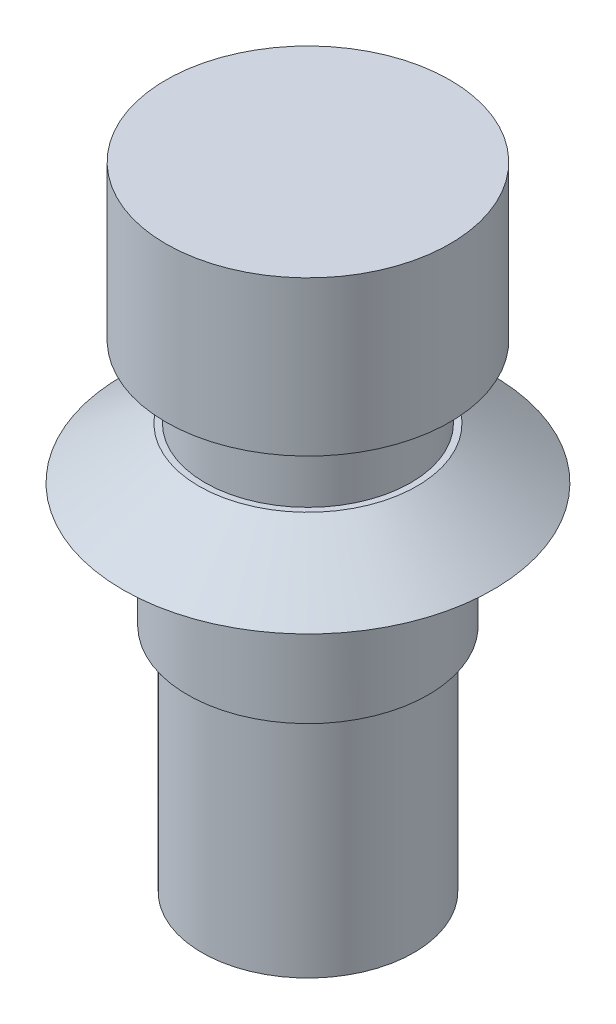
ISO-10303-21;
HEADER;
FILE_DESCRIPTION(('STEP AP214'),'2;1');
FILE_NAME('part.step','',(''),(''),'','','');
FILE_SCHEMA(('AUTOMOTIVE_DESIGN { 1 0 10303 214 1 1 1 1 }'));
ENDSEC;
DATA;
#1=APPLICATION_CONTEXT('core data for automotive mechanical design processes');
#2=APPLICATION_PROTOCOL_DEFINITION('international standard','automotive_design',2000,#1);
#3=PRODUCT_CONTEXT('',#1,'mechanical');
#4=PRODUCT('Part','Part','',(#3));
#5=PRODUCT_RELATED_PRODUCT_CATEGORY('part','',(#4));
#6=PRODUCT_DEFINITION_FORMATION('','',#4);
#7=PRODUCT_DEFINITION_CONTEXT('part definition',#1,'design');
#8=PRODUCT_DEFINITION('design','',#6,#7);
#9=PRODUCT_DEFINITION_SHAPE('','',#8);
#10=(LENGTH_UNIT() NAMED_UNIT(*) SI_UNIT(.MILLI.,.METRE.));
#11=(NAMED_UNIT(*) PLANE_ANGLE_UNIT() SI_UNIT($,.RADIAN.));
#12=(NAMED_UNIT(*) SI_UNIT($,.STERADIAN.) SOLID_ANGLE_UNIT());
#13=UNCERTAINTY_MEASURE_WITH_UNIT(LENGTH_MEASURE(1.E-05),#10,'distance_accuracy_value','');
#14=(GEOMETRIC_REPRESENTATION_CONTEXT(3) GLOBAL_UNCERTAINTY_ASSIGNED_CONTEXT((#13)) GLOBAL_UNIT_ASSIGNED_CONTEXT((#10,
#11,#12)) REPRESENTATION_CONTEXT('',''));
#15=CARTESIAN_POINT('',(0.,0.,0.));
#16=DIRECTION('',(0.,0.,1.));
#17=DIRECTION('',(1.,0.,0.));
#18=AXIS2_PLACEMENT_3D('',#15,#16,#17);
#19=CARTESIAN_POINT('',(0.,17.2,0.));
#20=DIRECTION('',(0.,-1.,0.));
#21=DIRECTION('',(0.,0.,-1.));
#22=AXIS2_PLACEMENT_3D('',#19,#20,#21);
#23=CYLINDRICAL_SURFACE('',#22,5.85);
#24=CARTESIAN_POINT('',(0.,17.2,0.));
#25=DIRECTION('',(0.,1.,0.));
#26=DIRECTION('',(0.,0.,1.));
#27=AXIS2_PLACEMENT_3D('',#24,#25,#26);
#28=CIRCLE('',#27,5.85);
#29=CARTESIAN_POINT('',(0.,17.2,5.85));
#30=VERTEX_POINT('',#29);
#31=EDGE_CURVE('E11',#30,#30,#28,.T.);
#32=ORIENTED_EDGE('',*,*,#31,.F.);
#33=EDGE_LOOP('',(#32));
#34=FACE_BOUND('',#33,.T.);
#35=CARTESIAN_POINT('',(0.,11.2,0.));
#36=DIRECTION('',(0.,-1.,0.));
#37=DIRECTION('',(0.,0.,-1.));
#38=AXIS2_PLACEMENT_3D('',#35,#36,#37);
#39=CIRCLE('',#38,5.85);
#40=CARTESIAN_POINT('',(0.,11.2,-5.85));
#41=VERTEX_POINT('',#40);
#42=EDGE_CURVE('E40',#41,#41,#39,.T.);
#43=ORIENTED_EDGE('',*,*,#42,.F.);
#44=EDGE_LOOP('',(#43));
#45=FACE_BOUND('',#44,.T.);
#46=ADVANCED_FACE('F37',(#34,#45),#23,.T.);
#47=CARTESIAN_POINT('',(0.,17.2,0.));
#48=DIRECTION('',(0.,-1.,0.));
#49=DIRECTION('',(0.,0.,1.));
#50=AXIS2_PLACEMENT_3D('',#47,#48,#49);
#51=CONICAL_SURFACE('',#50,9.,0.977384381116827);
#52=CARTESIAN_POINT('',(0.,19.7,0.));
#53=DIRECTION('',(0.,1.,0.));
#54=DIRECTION('',(0.,0.,1.));
#55=AXIS2_PLACEMENT_3D('',#52,#53,#54);
#56=CIRCLE('',#55,5.29359757871813);
#57=CARTESIAN_POINT('',(0.,19.7,5.29359757871813));
#58=VERTEX_POINT('',#57);
#59=EDGE_CURVE('E44',#58,#58,#56,.T.);
#60=ORIENTED_EDGE('',*,*,#59,.F.);
#61=EDGE_LOOP('',(#60));
#62=FACE_BOUND('',#61,.T.);
#63=CARTESIAN_POINT('',(0.,17.2,0.));
#64=DIRECTION('',(0.,1.,0.));
#65=DIRECTION('',(0.,0.,1.));
#66=AXIS2_PLACEMENT_3D('',#63,#64,#65);
#67=CIRCLE('',#66,9.);
#68=CARTESIAN_POINT('',(0.,17.2,9.));
#69=VERTEX_POINT('',#68);
#70=EDGE_CURVE('E48',#69,#69,#67,.T.);
#71=ORIENTED_EDGE('',*,*,#70,.T.);
#72=EDGE_LOOP('',(#71));
#73=FACE_BOUND('',#72,.T.);
#74=ADVANCED_FACE('F78',(#62,#73),#51,.T.);
#75=CARTESIAN_POINT('',(0.,19.7,0.));
#76=DIRECTION('',(0.,1.,0.));
#77=DIRECTION('',(0.,0.,1.));
#78=AXIS2_PLACEMENT_3D('',#75,#76,#77);
#79=PLANE('',#78);
#80=CARTESIAN_POINT('',(0.,19.7,0.));
#81=DIRECTION('',(0.,1.,0.));
#82=DIRECTION('',(0.,0.,1.));
#83=AXIS2_PLACEMENT_3D('',#80,#81,#82);
#84=CIRCLE('',#83,5.);
#85=CARTESIAN_POINT('',(0.,19.7,5.));
#86=VERTEX_POINT('',#85);
#87=EDGE_CURVE('E54',#86,#86,#84,.T.);
#88=ORIENTED_EDGE('',*,*,#87,.F.);
#89=EDGE_LOOP('',(#88));
#90=FACE_BOUND('',#89,.T.);
#91=ORIENTED_EDGE('',*,*,#59,.T.);
#92=EDGE_LOOP('',(#91));
#93=FACE_BOUND('',#92,.T.);
#94=ADVANCED_FACE('F83',(#90,#93),#79,.T.);
#95=CARTESIAN_POINT('',(0.,17.2,0.));
#96=DIRECTION('',(0.,1.,0.));
#97=DIRECTION('',(0.,0.,1.));
#98=AXIS2_PLACEMENT_3D('',#95,#96,#97);
#99=PLANE('',#98);
#100=ORIENTED_EDGE('',*,*,#31,.T.);
#101=EDGE_LOOP('',(#100));
#102=FACE_BOUND('',#101,.T.);
#103=ORIENTED_EDGE('',*,*,#70,.F.);
#104=EDGE_LOOP('',(#103));
#105=FACE_BOUND('',#104,.T.);
#106=ADVANCED_FACE('F89',(#102,#105),#99,.F.);
#107=CARTESIAN_POINT('',(0.,23.2,0.));
#108=DIRECTION('',(0.,-1.,0.));
#109=DIRECTION('',(0.,0.,-1.));
#110=AXIS2_PLACEMENT_3D('',#107,#108,#109);
#111=CYLINDRICAL_SURFACE('',#110,5.);
#112=CARTESIAN_POINT('',(0.,23.2,0.));
#113=DIRECTION('',(0.,1.,0.));
#114=DIRECTION('',(0.,0.,1.));
#115=AXIS2_PLACEMENT_3D('',#112,#113,#114);
#116=CIRCLE('',#115,5.);
#117=CARTESIAN_POINT('',(0.,23.2,5.));
#118=VERTEX_POINT('',#117);
#119=EDGE_CURVE('E53',#118,#118,#116,.T.);
#120=ORIENTED_EDGE('',*,*,#119,.F.);
#121=EDGE_LOOP('',(#120));
#122=FACE_BOUND('',#121,.T.);
#123=ORIENTED_EDGE('',*,*,#87,.T.);
#124=EDGE_LOOP('',(#123));
#125=FACE_BOUND('',#124,.T.);
#126=ADVANCED_FACE('F122',(#122,#125),#111,.T.);
#127=CARTESIAN_POINT('',(0.,30.7,0.));
#128=DIRECTION('',(0.,-1.,0.));
#129=DIRECTION('',(0.,0.,-1.));
#130=AXIS2_PLACEMENT_3D('',#127,#128,#129);
#131=CYLINDRICAL_SURFACE('',#130,6.9);
#132=CARTESIAN_POINT('',(0.,30.7,0.));
#133=DIRECTION('',(0.,1.,0.));
#134=DIRECTION('',(0.,0.,1.));
#135=AXIS2_PLACEMENT_3D('',#132,#133,#134);
#136=CIRCLE('',#135,6.9);
#137=CARTESIAN_POINT('',(0.,30.7,6.9));
#138=VERTEX_POINT('',#137);
#139=EDGE_CURVE('E57',#138,#138,#136,.T.);
#140=ORIENTED_EDGE('',*,*,#139,.F.);
#141=EDGE_LOOP('',(#140));
#142=FACE_BOUND('',#141,.T.);
#143=CARTESIAN_POINT('',(0.,23.2,0.));
#144=DIRECTION('',(0.,1.,0.));
#145=DIRECTION('',(0.,0.,1.));
#146=AXIS2_PLACEMENT_3D('',#143,#144,#145);
#147=CIRCLE('',#146,6.9);
#148=CARTESIAN_POINT('',(0.,23.2,6.9));
#149=VERTEX_POINT('',#148);
#150=EDGE_CURVE('E60',#149,#149,#147,.T.);
#151=ORIENTED_EDGE('',*,*,#150,.T.);
#152=EDGE_LOOP('',(#151));
#153=FACE_BOUND('',#152,.T.);
#154=ADVANCED_FACE('F115',(#142,#153),#131,.T.);
#155=CARTESIAN_POINT('',(0.,30.7,0.));
#156=DIRECTION('',(0.,1.,0.));
#157=DIRECTION('',(0.,0.,1.));
#158=AXIS2_PLACEMENT_3D('',#155,#156,#157);
#159=PLANE('',#158);
#160=ORIENTED_EDGE('',*,*,#139,.T.);
#161=EDGE_LOOP('',(#160));
#162=FACE_BOUND('',#161,.T.);
#163=ADVANCED_FACE('F112',(#162),#159,.T.);
#164=CARTESIAN_POINT('',(0.,23.2,0.));
#165=DIRECTION('',(0.,1.,0.));
#166=DIRECTION('',(0.,0.,1.));
#167=AXIS2_PLACEMENT_3D('',#164,#165,#166);
#168=PLANE('',#167);
#169=ORIENTED_EDGE('',*,*,#119,.T.);
#170=EDGE_LOOP('',(#169));
#171=FACE_BOUND('',#170,.T.);
#172=ORIENTED_EDGE('',*,*,#150,.F.);
#173=EDGE_LOOP('',(#172));
#174=FACE_BOUND('',#173,.T.);
#175=ADVANCED_FACE('F108',(#171,#174),#168,.F.);
#176=CARTESIAN_POINT('',(0.,11.2,0.));
#177=DIRECTION('',(0.,-1.,0.));
#178=DIRECTION('',(0.,0.,-1.));
#179=AXIS2_PLACEMENT_3D('',#176,#177,#178);
#180=PLANE('',#179);
#181=CARTESIAN_POINT('',(0.,11.2,0.));
#182=DIRECTION('',(0.,-1.,0.));
#183=DIRECTION('',(0.,0.,-1.));
#184=AXIS2_PLACEMENT_3D('',#181,#182,#183);
#185=CIRCLE('',#184,5.15);
#186=CARTESIAN_POINT('',(0.,11.2,-5.15));
#187=VERTEX_POINT('',#186);
#188=EDGE_CURVE('E68',#187,#187,#185,.T.);
#189=ORIENTED_EDGE('',*,*,#188,.F.);
#190=EDGE_LOOP('',(#189));
#191=FACE_BOUND('',#190,.T.);
#192=ORIENTED_EDGE('',*,*,#42,.T.);
#193=EDGE_LOOP('',(#192));
#194=FACE_BOUND('',#193,.T.);
#195=ADVANCED_FACE('F75',(#191,#194),#180,.T.);
#196=CARTESIAN_POINT('',(0.,11.2,0.));
#197=DIRECTION('',(0.,-1.,0.));
#198=DIRECTION('',(0.,0.,-1.));
#199=AXIS2_PLACEMENT_3D('',#196,#197,#198);
#200=CYLINDRICAL_SURFACE('',#199,5.15);
#201=ORIENTED_EDGE('',*,*,#188,.T.);
#202=EDGE_LOOP('',(#201));
#203=FACE_BOUND('',#202,.T.);
#204=CARTESIAN_POINT('',(0.,0.,0.));
#205=DIRECTION('',(0.,-1.,0.));
#206=DIRECTION('',(0.,0.,-1.));
#207=AXIS2_PLACEMENT_3D('',#204,#205,#206);
#208=CIRCLE('',#207,5.15);
#209=CARTESIAN_POINT('',(0.,0.,-5.15));
#210=VERTEX_POINT('',#209);
#211=EDGE_CURVE('E65',#210,#210,#208,.T.);
#212=ORIENTED_EDGE('',*,*,#211,.F.);
#213=EDGE_LOOP('',(#212));
#214=FACE_BOUND('',#213,.T.);
#215=ADVANCED_FACE('F97',(#203,#214),#200,.T.);
#216=CARTESIAN_POINT('',(0.,0.,0.));
#217=DIRECTION('',(0.,1.,0.));
#218=DIRECTION('',(0.,0.,1.));
#219=AXIS2_PLACEMENT_3D('',#216,#217,#218);
#220=PLANE('',#219);
#221=ORIENTED_EDGE('',*,*,#211,.T.);
#222=EDGE_LOOP('',(#221));
#223=FACE_BOUND('',#222,.T.);
#224=ADVANCED_FACE('F95',(#223),#220,.F.);
#225=CLOSED_SHELL('',(#46,#74,#94,#106,#126,#154,#163,#175,#195,#215,#224));
#226=MANIFOLD_SOLID_BREP('B2',#225);
#227=ADVANCED_BREP_SHAPE_REPRESENTATION('',(#18,#226),#14);
#228=SHAPE_DEFINITION_REPRESENTATION(#9,#227);
ENDSEC;
END-ISO-10303-21;
